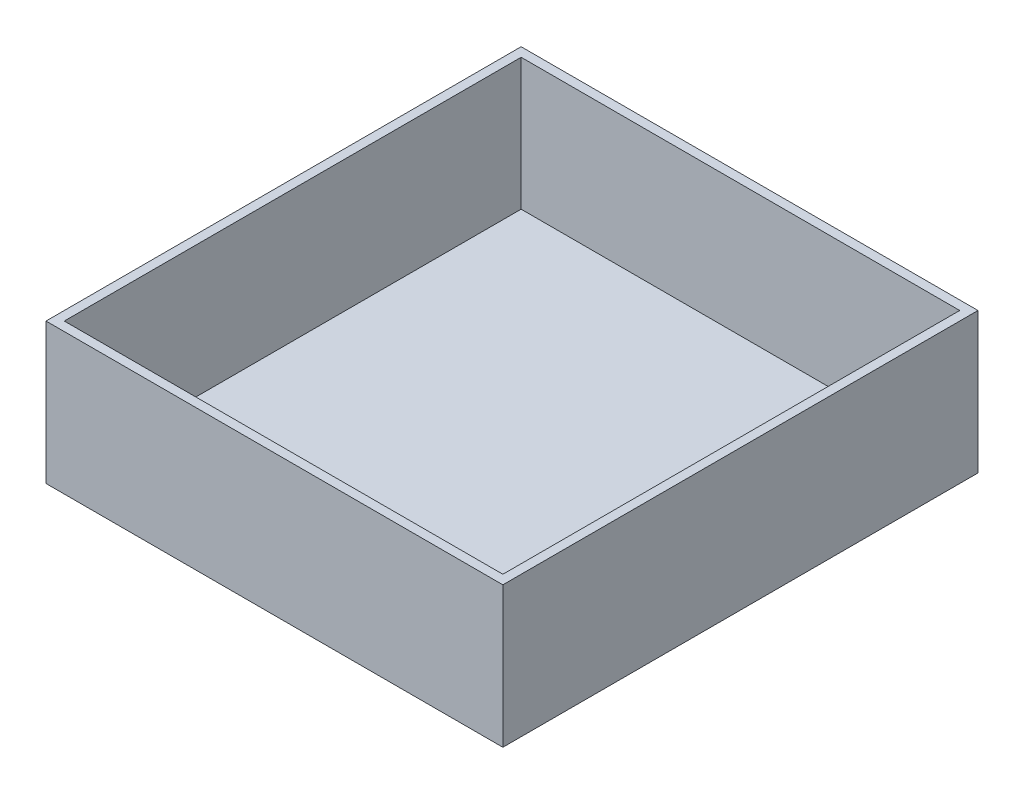
ISO-10303-21;
HEADER;
FILE_DESCRIPTION(('STEP AP214'),'2;1');
FILE_NAME('part.step','',(''),(''),'','','');
FILE_SCHEMA(('AUTOMOTIVE_DESIGN { 1 0 10303 214 1 1 1 1 }'));
ENDSEC;
DATA;
#1=APPLICATION_CONTEXT('core data for automotive mechanical design processes');
#2=APPLICATION_PROTOCOL_DEFINITION('international standard','automotive_design',2000,#1);
#3=PRODUCT_CONTEXT('',#1,'mechanical');
#4=PRODUCT('Part','Part','',(#3));
#5=PRODUCT_RELATED_PRODUCT_CATEGORY('part','',(#4));
#6=PRODUCT_DEFINITION_FORMATION('','',#4);
#7=PRODUCT_DEFINITION_CONTEXT('part definition',#1,'design');
#8=PRODUCT_DEFINITION('design','',#6,#7);
#9=PRODUCT_DEFINITION_SHAPE('','',#8);
#10=(LENGTH_UNIT() NAMED_UNIT(*) SI_UNIT(.MILLI.,.METRE.));
#11=(NAMED_UNIT(*) PLANE_ANGLE_UNIT() SI_UNIT($,.RADIAN.));
#12=(NAMED_UNIT(*) SI_UNIT($,.STERADIAN.) SOLID_ANGLE_UNIT());
#13=UNCERTAINTY_MEASURE_WITH_UNIT(LENGTH_MEASURE(1.E-05),#10,'distance_accuracy_value','');
#14=(GEOMETRIC_REPRESENTATION_CONTEXT(3) GLOBAL_UNCERTAINTY_ASSIGNED_CONTEXT((#13)) GLOBAL_UNIT_ASSIGNED_CONTEXT((#10,
#11,#12)) REPRESENTATION_CONTEXT('',''));
#15=CARTESIAN_POINT('',(0.,0.,0.));
#16=DIRECTION('',(0.,0.,1.));
#17=DIRECTION('',(1.,0.,0.));
#18=AXIS2_PLACEMENT_3D('',#15,#16,#17);
#19=CARTESIAN_POINT('',(79.375,3.175,82.55));
#20=DIRECTION('',(-1.,0.,0.));
#21=DIRECTION('',(0.,0.,1.));
#22=AXIS2_PLACEMENT_3D('',#19,#20,#21);
#23=PLANE('',#22);
#24=DIRECTION('',(0.,0.,-1.));
#25=VECTOR('',#24,1.);
#26=CARTESIAN_POINT('',(79.375,0.,82.55));
#27=LINE('',#26,#25);
#28=CARTESIAN_POINT('',(79.375,0.,82.55));
#29=VERTEX_POINT('',#28);
#30=CARTESIAN_POINT('',(79.375,0.,-82.55));
#31=VERTEX_POINT('',#30);
#32=EDGE_CURVE('E148',#29,#31,#27,.T.);
#33=ORIENTED_EDGE('',*,*,#32,.T.);
#34=DIRECTION('',(0.,-1.,0.));
#35=VECTOR('',#34,1.);
#36=CARTESIAN_POINT('',(79.375,3.175,-82.55));
#37=LINE('',#36,#35);
#38=CARTESIAN_POINT('',(79.375,48.895,-82.55));
#39=VERTEX_POINT('',#38);
#40=EDGE_CURVE('E11',#39,#31,#37,.T.);
#41=ORIENTED_EDGE('',*,*,#40,.F.);
#42=DIRECTION('',(0.,0.,-1.));
#43=VECTOR('',#42,1.);
#44=CARTESIAN_POINT('',(79.375,48.895,82.55));
#45=LINE('',#44,#43);
#46=CARTESIAN_POINT('',(79.375,48.895,82.55));
#47=VERTEX_POINT('',#46);
#48=EDGE_CURVE('E139',#47,#39,#45,.T.);
#49=ORIENTED_EDGE('',*,*,#48,.F.);
#50=DIRECTION('',(0.,-1.,0.));
#51=VECTOR('',#50,1.);
#52=CARTESIAN_POINT('',(79.375,3.175,82.55));
#53=LINE('',#52,#51);
#54=EDGE_CURVE('E156',#47,#29,#53,.T.);
#55=ORIENTED_EDGE('',*,*,#54,.T.);
#56=EDGE_LOOP('',(#33,#41,#49,#55));
#57=FACE_BOUND('',#56,.T.);
#58=ADVANCED_FACE('F31',(#57),#23,.F.);
#59=CARTESIAN_POINT('',(-79.375,3.175,-82.55));
#60=DIRECTION('',(0.,0.,1.));
#61=DIRECTION('',(1.,0.,0.));
#62=AXIS2_PLACEMENT_3D('',#59,#60,#61);
#63=PLANE('',#62);
#64=DIRECTION('',(-1.,0.,0.));
#65=VECTOR('',#64,1.);
#66=CARTESIAN_POINT('',(-79.375,0.,-82.55));
#67=LINE('',#66,#65);
#68=CARTESIAN_POINT('',(-79.375,0.,-82.55));
#69=VERTEX_POINT('',#68);
#70=EDGE_CURVE('E151',#31,#69,#67,.T.);
#71=ORIENTED_EDGE('',*,*,#70,.T.);
#72=DIRECTION('',(0.,-1.,0.));
#73=VECTOR('',#72,1.);
#74=CARTESIAN_POINT('',(-79.375,3.175,-82.55));
#75=LINE('',#74,#73);
#76=CARTESIAN_POINT('',(-79.375,48.895,-82.55));
#77=VERTEX_POINT('',#76);
#78=EDGE_CURVE('E38',#77,#69,#75,.T.);
#79=ORIENTED_EDGE('',*,*,#78,.F.);
#80=DIRECTION('',(-1.,0.,0.));
#81=VECTOR('',#80,1.);
#82=CARTESIAN_POINT('',(79.375,48.895,-82.55));
#83=LINE('',#82,#81);
#84=EDGE_CURVE('E142',#39,#77,#83,.T.);
#85=ORIENTED_EDGE('',*,*,#84,.F.);
#86=ORIENTED_EDGE('',*,*,#40,.T.);
#87=EDGE_LOOP('',(#71,#79,#85,#86));
#88=FACE_BOUND('',#87,.T.);
#89=ADVANCED_FACE('F174',(#88),#63,.F.);
#90=CARTESIAN_POINT('',(-79.375,3.175,82.55));
#91=DIRECTION('',(1.,0.,0.));
#92=DIRECTION('',(0.,0.,-1.));
#93=AXIS2_PLACEMENT_3D('',#90,#91,#92);
#94=PLANE('',#93);
#95=DIRECTION('',(0.,0.,1.));
#96=VECTOR('',#95,1.);
#97=CARTESIAN_POINT('',(-79.375,0.,82.55));
#98=LINE('',#97,#96);
#99=CARTESIAN_POINT('',(-79.375,0.,82.55));
#100=VERTEX_POINT('',#99);
#101=EDGE_CURVE('E153',#69,#100,#98,.T.);
#102=ORIENTED_EDGE('',*,*,#101,.T.);
#103=DIRECTION('',(0.,-1.,0.));
#104=VECTOR('',#103,1.);
#105=CARTESIAN_POINT('',(-79.375,3.175,82.55));
#106=LINE('',#105,#104);
#107=CARTESIAN_POINT('',(-79.375,48.895,82.55));
#108=VERTEX_POINT('',#107);
#109=EDGE_CURVE('E158',#108,#100,#106,.T.);
#110=ORIENTED_EDGE('',*,*,#109,.F.);
#111=DIRECTION('',(0.,0.,1.));
#112=VECTOR('',#111,1.);
#113=CARTESIAN_POINT('',(-79.375,48.895,-82.55));
#114=LINE('',#113,#112);
#115=EDGE_CURVE('E145',#77,#108,#114,.T.);
#116=ORIENTED_EDGE('',*,*,#115,.F.);
#117=ORIENTED_EDGE('',*,*,#78,.T.);
#118=EDGE_LOOP('',(#102,#110,#116,#117));
#119=FACE_BOUND('',#118,.T.);
#120=ADVANCED_FACE('F163',(#119),#94,.F.);
#121=CARTESIAN_POINT('',(-79.375,3.175,82.55));
#122=DIRECTION('',(0.,0.,-1.));
#123=DIRECTION('',(-1.,0.,0.));
#124=AXIS2_PLACEMENT_3D('',#121,#122,#123);
#125=PLANE('',#124);
#126=DIRECTION('',(1.,0.,0.));
#127=VECTOR('',#126,1.);
#128=CARTESIAN_POINT('',(-79.375,0.,82.55));
#129=LINE('',#128,#127);
#130=EDGE_CURVE('E53',#100,#29,#129,.T.);
#131=ORIENTED_EDGE('',*,*,#130,.T.);
#132=ORIENTED_EDGE('',*,*,#54,.F.);
#133=DIRECTION('',(1.,0.,0.));
#134=VECTOR('',#133,1.);
#135=CARTESIAN_POINT('',(-79.375,48.895,82.55));
#136=LINE('',#135,#134);
#137=EDGE_CURVE('E113',#108,#47,#136,.T.);
#138=ORIENTED_EDGE('',*,*,#137,.F.);
#139=ORIENTED_EDGE('',*,*,#109,.T.);
#140=EDGE_LOOP('',(#131,#132,#138,#139));
#141=FACE_BOUND('',#140,.T.);
#142=ADVANCED_FACE('F172',(#141),#125,.F.);
#143=CARTESIAN_POINT('',(79.375,0.,-82.55));
#144=DIRECTION('',(0.,-1.,0.));
#145=DIRECTION('',(0.,0.,-1.));
#146=AXIS2_PLACEMENT_3D('',#143,#144,#145);
#147=PLANE('',#146);
#148=ORIENTED_EDGE('',*,*,#32,.F.);
#149=ORIENTED_EDGE('',*,*,#130,.F.);
#150=ORIENTED_EDGE('',*,*,#101,.F.);
#151=ORIENTED_EDGE('',*,*,#70,.F.);
#152=EDGE_LOOP('',(#148,#149,#150,#151));
#153=FACE_BOUND('',#152,.T.);
#154=ADVANCED_FACE('F168',(#153),#147,.T.);
#155=CARTESIAN_POINT('',(79.375,48.895,82.55));
#156=DIRECTION('',(0.,1.,0.));
#157=DIRECTION('',(0.,0.,1.));
#158=AXIS2_PLACEMENT_3D('',#155,#156,#157);
#159=PLANE('',#158);
#160=ORIENTED_EDGE('',*,*,#137,.T.);
#161=ORIENTED_EDGE('',*,*,#48,.T.);
#162=ORIENTED_EDGE('',*,*,#84,.T.);
#163=ORIENTED_EDGE('',*,*,#115,.T.);
#164=EDGE_LOOP('',(#160,#161,#162,#163));
#165=FACE_BOUND('',#164,.T.);
#166=DIRECTION('',(0.,0.,-1.));
#167=VECTOR('',#166,1.);
#168=CARTESIAN_POINT('',(76.2,48.895,79.375));
#169=LINE('',#168,#167);
#170=CARTESIAN_POINT('',(76.2,48.895,79.375));
#171=VERTEX_POINT('',#170);
#172=CARTESIAN_POINT('',(76.2,48.895,-79.375));
#173=VERTEX_POINT('',#172);
#174=EDGE_CURVE('E105',#171,#173,#169,.T.);
#175=ORIENTED_EDGE('',*,*,#174,.F.);
#176=DIRECTION('',(1.,0.,0.));
#177=VECTOR('',#176,1.);
#178=CARTESIAN_POINT('',(-76.2,48.895,79.375));
#179=LINE('',#178,#177);
#180=CARTESIAN_POINT('',(-76.2,48.895,79.375));
#181=VERTEX_POINT('',#180);
#182=EDGE_CURVE('E97',#181,#171,#179,.T.);
#183=ORIENTED_EDGE('',*,*,#182,.F.);
#184=DIRECTION('',(0.,0.,1.));
#185=VECTOR('',#184,1.);
#186=CARTESIAN_POINT('',(-76.2,48.895,-79.375));
#187=LINE('',#186,#185);
#188=CARTESIAN_POINT('',(-76.2,48.895,-79.375));
#189=VERTEX_POINT('',#188);
#190=EDGE_CURVE('E121',#189,#181,#187,.T.);
#191=ORIENTED_EDGE('',*,*,#190,.F.);
#192=DIRECTION('',(-1.,0.,0.));
#193=VECTOR('',#192,1.);
#194=CARTESIAN_POINT('',(76.2,48.895,-79.375));
#195=LINE('',#194,#193);
#196=EDGE_CURVE('E119',#173,#189,#195,.T.);
#197=ORIENTED_EDGE('',*,*,#196,.F.);
#198=EDGE_LOOP('',(#175,#183,#191,#197));
#199=FACE_BOUND('',#198,.T.);
#200=ADVANCED_FACE('F117',(#165,#199),#159,.T.);
#201=CARTESIAN_POINT('',(-76.2,48.895,79.375));
#202=DIRECTION('',(0.,0.,-1.));
#203=DIRECTION('',(-1.,0.,0.));
#204=AXIS2_PLACEMENT_3D('',#201,#202,#203);
#205=PLANE('',#204);
#206=DIRECTION('',(1.,0.,0.));
#207=VECTOR('',#206,1.);
#208=CARTESIAN_POINT('',(-76.2,3.175,79.375));
#209=LINE('',#208,#207);
#210=CARTESIAN_POINT('',(-76.2,3.175,79.375));
#211=VERTEX_POINT('',#210);
#212=CARTESIAN_POINT('',(76.2,3.175,79.375));
#213=VERTEX_POINT('',#212);
#214=EDGE_CURVE('E125',#211,#213,#209,.T.);
#215=ORIENTED_EDGE('',*,*,#214,.F.);
#216=DIRECTION('',(0.,-1.,0.));
#217=VECTOR('',#216,1.);
#218=CARTESIAN_POINT('',(-76.2,48.895,79.375));
#219=LINE('',#218,#217);
#220=EDGE_CURVE('E45',#181,#211,#219,.T.);
#221=ORIENTED_EDGE('',*,*,#220,.F.);
#222=ORIENTED_EDGE('',*,*,#182,.T.);
#223=DIRECTION('',(0.,-1.,0.));
#224=VECTOR('',#223,1.);
#225=CARTESIAN_POINT('',(76.2,48.895,79.375));
#226=LINE('',#225,#224);
#227=EDGE_CURVE('E100',#171,#213,#226,.T.);
#228=ORIENTED_EDGE('',*,*,#227,.T.);
#229=EDGE_LOOP('',(#215,#221,#222,#228));
#230=FACE_BOUND('',#229,.T.);
#231=ADVANCED_FACE('F99',(#230),#205,.T.);
#232=CARTESIAN_POINT('',(76.2,48.895,79.375));
#233=DIRECTION('',(-1.,0.,0.));
#234=DIRECTION('',(0.,0.,1.));
#235=AXIS2_PLACEMENT_3D('',#232,#233,#234);
#236=PLANE('',#235);
#237=DIRECTION('',(0.,0.,-1.));
#238=VECTOR('',#237,1.);
#239=CARTESIAN_POINT('',(76.2,3.175,79.375));
#240=LINE('',#239,#238);
#241=CARTESIAN_POINT('',(76.2,3.175,-79.375));
#242=VERTEX_POINT('',#241);
#243=EDGE_CURVE('E112',#213,#242,#240,.T.);
#244=ORIENTED_EDGE('',*,*,#243,.F.);
#245=ORIENTED_EDGE('',*,*,#227,.F.);
#246=ORIENTED_EDGE('',*,*,#174,.T.);
#247=DIRECTION('',(0.,-1.,0.));
#248=VECTOR('',#247,1.);
#249=CARTESIAN_POINT('',(76.2,48.895,-79.375));
#250=LINE('',#249,#248);
#251=EDGE_CURVE('E114',#173,#242,#250,.T.);
#252=ORIENTED_EDGE('',*,*,#251,.T.);
#253=EDGE_LOOP('',(#244,#245,#246,#252));
#254=FACE_BOUND('',#253,.T.);
#255=ADVANCED_FACE('F109',(#254),#236,.T.);
#256=CARTESIAN_POINT('',(76.2,48.895,-79.375));
#257=DIRECTION('',(0.,0.,1.));
#258=DIRECTION('',(1.,0.,0.));
#259=AXIS2_PLACEMENT_3D('',#256,#257,#258);
#260=PLANE('',#259);
#261=DIRECTION('',(-1.,0.,0.));
#262=VECTOR('',#261,1.);
#263=CARTESIAN_POINT('',(76.2,3.175,-79.375));
#264=LINE('',#263,#262);
#265=CARTESIAN_POINT('',(-76.2,3.175,-79.375));
#266=VERTEX_POINT('',#265);
#267=EDGE_CURVE('E128',#242,#266,#264,.T.);
#268=ORIENTED_EDGE('',*,*,#267,.F.);
#269=ORIENTED_EDGE('',*,*,#251,.F.);
#270=ORIENTED_EDGE('',*,*,#196,.T.);
#271=DIRECTION('',(0.,-1.,0.));
#272=VECTOR('',#271,1.);
#273=CARTESIAN_POINT('',(-76.2,48.895,-79.375));
#274=LINE('',#273,#272);
#275=EDGE_CURVE('E134',#189,#266,#274,.T.);
#276=ORIENTED_EDGE('',*,*,#275,.T.);
#277=EDGE_LOOP('',(#268,#269,#270,#276));
#278=FACE_BOUND('',#277,.T.);
#279=ADVANCED_FACE('F197',(#278),#260,.T.);
#280=CARTESIAN_POINT('',(-76.2,48.895,-79.375));
#281=DIRECTION('',(1.,0.,0.));
#282=DIRECTION('',(0.,0.,-1.));
#283=AXIS2_PLACEMENT_3D('',#280,#281,#282);
#284=PLANE('',#283);
#285=DIRECTION('',(0.,0.,1.));
#286=VECTOR('',#285,1.);
#287=CARTESIAN_POINT('',(-76.2,3.175,-79.375));
#288=LINE('',#287,#286);
#289=EDGE_CURVE('E106',#266,#211,#288,.T.);
#290=ORIENTED_EDGE('',*,*,#289,.F.);
#291=ORIENTED_EDGE('',*,*,#275,.F.);
#292=ORIENTED_EDGE('',*,*,#190,.T.);
#293=ORIENTED_EDGE('',*,*,#220,.T.);
#294=EDGE_LOOP('',(#290,#291,#292,#293));
#295=FACE_BOUND('',#294,.T.);
#296=ADVANCED_FACE('F189',(#295),#284,.T.);
#297=CARTESIAN_POINT('',(79.375,3.175,-82.55));
#298=DIRECTION('',(0.,-1.,0.));
#299=DIRECTION('',(0.,0.,-1.));
#300=AXIS2_PLACEMENT_3D('',#297,#298,#299);
#301=PLANE('',#300);
#302=ORIENTED_EDGE('',*,*,#289,.T.);
#303=ORIENTED_EDGE('',*,*,#214,.T.);
#304=ORIENTED_EDGE('',*,*,#243,.T.);
#305=ORIENTED_EDGE('',*,*,#267,.T.);
#306=EDGE_LOOP('',(#302,#303,#304,#305));
#307=FACE_BOUND('',#306,.T.);
#308=ADVANCED_FACE('F186',(#307),#301,.F.);
#309=CLOSED_SHELL('',(#58,#89,#120,#142,#154,#200,#231,#255,#279,#296,#308));
#310=MANIFOLD_SOLID_BREP('B2',#309);
#311=ADVANCED_BREP_SHAPE_REPRESENTATION('',(#18,#310),#14);
#312=SHAPE_DEFINITION_REPRESENTATION(#9,#311);
ENDSEC;
END-ISO-10303-21;
